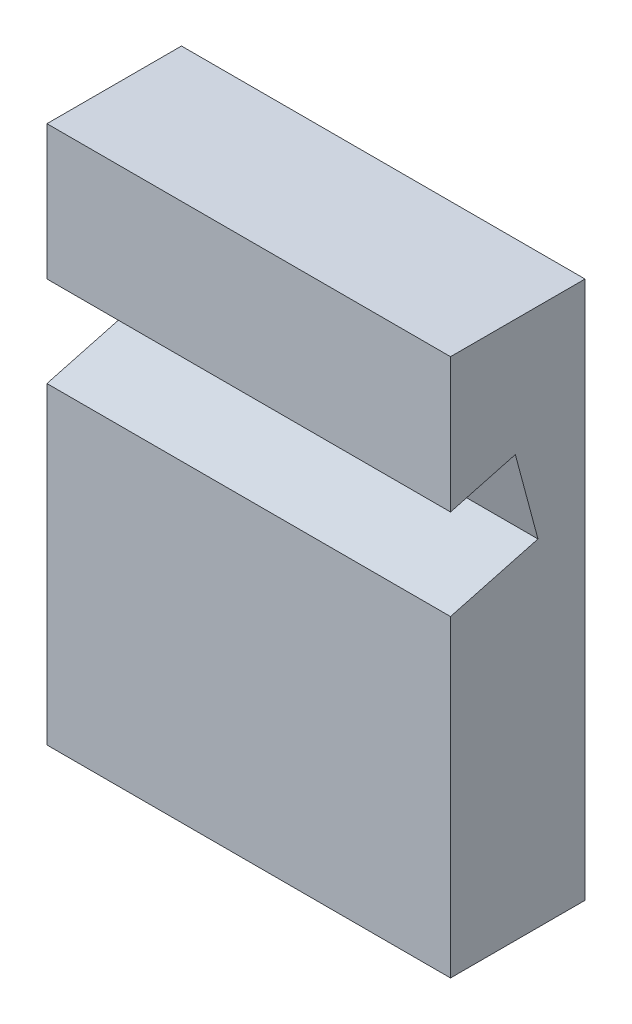
ISO-10303-21;
HEADER;
FILE_DESCRIPTION(('STEP AP214'),'2;1');
FILE_NAME('part.step','',(''),(''),'','','');
FILE_SCHEMA(('AUTOMOTIVE_DESIGN { 1 0 10303 214 1 1 1 1 }'));
ENDSEC;
DATA;
#1=APPLICATION_CONTEXT('core data for automotive mechanical design processes');
#2=APPLICATION_PROTOCOL_DEFINITION('international standard','automotive_design',2000,#1);
#3=PRODUCT_CONTEXT('',#1,'mechanical');
#4=PRODUCT('Part','Part','',(#3));
#5=PRODUCT_RELATED_PRODUCT_CATEGORY('part','',(#4));
#6=PRODUCT_DEFINITION_FORMATION('','',#4);
#7=PRODUCT_DEFINITION_CONTEXT('part definition',#1,'design');
#8=PRODUCT_DEFINITION('design','',#6,#7);
#9=PRODUCT_DEFINITION_SHAPE('','',#8);
#10=(LENGTH_UNIT() NAMED_UNIT(*) SI_UNIT(.MILLI.,.METRE.));
#11=(NAMED_UNIT(*) PLANE_ANGLE_UNIT() SI_UNIT($,.RADIAN.));
#12=(NAMED_UNIT(*) SI_UNIT($,.STERADIAN.) SOLID_ANGLE_UNIT());
#13=UNCERTAINTY_MEASURE_WITH_UNIT(LENGTH_MEASURE(1.E-05),#10,'distance_accuracy_value','');
#14=(GEOMETRIC_REPRESENTATION_CONTEXT(3) GLOBAL_UNCERTAINTY_ASSIGNED_CONTEXT((#13)) GLOBAL_UNIT_ASSIGNED_CONTEXT((#10,
#11,#12)) REPRESENTATION_CONTEXT('',''));
#15=CARTESIAN_POINT('',(0.,0.,0.));
#16=DIRECTION('',(0.,0.,1.));
#17=DIRECTION('',(1.,0.,0.));
#18=AXIS2_PLACEMENT_3D('',#15,#16,#17);
#19=CARTESIAN_POINT('',(60.,0.,20.));
#20=DIRECTION('',(0.,1.,0.));
#21=DIRECTION('',(0.,0.,1.));
#22=AXIS2_PLACEMENT_3D('',#19,#20,#21);
#23=PLANE('',#22);
#24=DIRECTION('',(0.,0.,-1.));
#25=VECTOR('',#24,1.);
#26=CARTESIAN_POINT('',(0.,0.,20.));
#27=LINE('',#26,#25);
#28=CARTESIAN_POINT('',(0.,0.,20.));
#29=VERTEX_POINT('',#28);
#30=CARTESIAN_POINT('',(0.,0.,0.));
#31=VERTEX_POINT('',#30);
#32=EDGE_CURVE('E139',#29,#31,#27,.T.);
#33=ORIENTED_EDGE('',*,*,#32,.T.);
#34=DIRECTION('',(-1.,0.,0.));
#35=VECTOR('',#34,1.);
#36=CARTESIAN_POINT('',(60.,0.,0.));
#37=LINE('',#36,#35);
#38=CARTESIAN_POINT('',(60.,0.,0.));
#39=VERTEX_POINT('',#38);
#40=EDGE_CURVE('E11',#39,#31,#37,.T.);
#41=ORIENTED_EDGE('',*,*,#40,.F.);
#42=DIRECTION('',(0.,0.,-1.));
#43=VECTOR('',#42,1.);
#44=CARTESIAN_POINT('',(60.,0.,20.));
#45=LINE('',#44,#43);
#46=CARTESIAN_POINT('',(60.,0.,20.));
#47=VERTEX_POINT('',#46);
#48=EDGE_CURVE('E153',#47,#39,#45,.T.);
#49=ORIENTED_EDGE('',*,*,#48,.F.);
#50=DIRECTION('',(-1.,0.,0.));
#51=VECTOR('',#50,1.);
#52=CARTESIAN_POINT('',(60.,0.,20.));
#53=LINE('',#52,#51);
#54=EDGE_CURVE('E135',#47,#29,#53,.T.);
#55=ORIENTED_EDGE('',*,*,#54,.T.);
#56=EDGE_LOOP('',(#33,#41,#49,#55));
#57=FACE_BOUND('',#56,.T.);
#58=ADVANCED_FACE('F43',(#57),#23,.F.);
#59=CARTESIAN_POINT('',(60.,0.,0.));
#60=DIRECTION('',(0.,0.,1.));
#61=DIRECTION('',(1.,0.,0.));
#62=AXIS2_PLACEMENT_3D('',#59,#60,#61);
#63=PLANE('',#62);
#64=DIRECTION('',(0.,1.,0.));
#65=VECTOR('',#64,1.);
#66=CARTESIAN_POINT('',(0.,0.,0.));
#67=LINE('',#66,#65);
#68=CARTESIAN_POINT('',(0.,80.,0.));
#69=VERTEX_POINT('',#68);
#70=EDGE_CURVE('E142',#31,#69,#67,.T.);
#71=ORIENTED_EDGE('',*,*,#70,.T.);
#72=DIRECTION('',(-1.,0.,0.));
#73=VECTOR('',#72,1.);
#74=CARTESIAN_POINT('',(60.,80.,0.));
#75=LINE('',#74,#73);
#76=CARTESIAN_POINT('',(60.,80.,0.));
#77=VERTEX_POINT('',#76);
#78=EDGE_CURVE('E51',#77,#69,#75,.T.);
#79=ORIENTED_EDGE('',*,*,#78,.F.);
#80=DIRECTION('',(0.,1.,0.));
#81=VECTOR('',#80,1.);
#82=CARTESIAN_POINT('',(60.,0.,0.));
#83=LINE('',#82,#81);
#84=EDGE_CURVE('E102',#39,#77,#83,.T.);
#85=ORIENTED_EDGE('',*,*,#84,.F.);
#86=ORIENTED_EDGE('',*,*,#40,.T.);
#87=EDGE_LOOP('',(#71,#79,#85,#86));
#88=FACE_BOUND('',#87,.T.);
#89=ADVANCED_FACE('F188',(#88),#63,.F.);
#90=CARTESIAN_POINT('',(60.,80.,0.));
#91=DIRECTION('',(0.,-1.,0.));
#92=DIRECTION('',(0.,0.,-1.));
#93=AXIS2_PLACEMENT_3D('',#90,#91,#92);
#94=PLANE('',#93);
#95=DIRECTION('',(0.,0.,1.));
#96=VECTOR('',#95,1.);
#97=CARTESIAN_POINT('',(0.,80.,0.));
#98=LINE('',#97,#96);
#99=CARTESIAN_POINT('',(0.,80.,20.));
#100=VERTEX_POINT('',#99);
#101=EDGE_CURVE('E144',#69,#100,#98,.T.);
#102=ORIENTED_EDGE('',*,*,#101,.T.);
#103=DIRECTION('',(-1.,0.,0.));
#104=VECTOR('',#103,1.);
#105=CARTESIAN_POINT('',(60.,80.,20.));
#106=LINE('',#105,#104);
#107=CARTESIAN_POINT('',(60.,80.,20.));
#108=VERTEX_POINT('',#107);
#109=EDGE_CURVE('E160',#108,#100,#106,.T.);
#110=ORIENTED_EDGE('',*,*,#109,.F.);
#111=DIRECTION('',(0.,0.,1.));
#112=VECTOR('',#111,1.);
#113=CARTESIAN_POINT('',(60.,80.,0.));
#114=LINE('',#113,#112);
#115=EDGE_CURVE('E168',#77,#108,#114,.T.);
#116=ORIENTED_EDGE('',*,*,#115,.F.);
#117=ORIENTED_EDGE('',*,*,#78,.T.);
#118=EDGE_LOOP('',(#102,#110,#116,#117));
#119=FACE_BOUND('',#118,.T.);
#120=ADVANCED_FACE('F166',(#119),#94,.F.);
#121=CARTESIAN_POINT('',(60.,80.,20.));
#122=DIRECTION('',(0.,0.,-1.));
#123=DIRECTION('',(0.,1.,0.));
#124=AXIS2_PLACEMENT_3D('',#121,#122,#123);
#125=PLANE('',#124);
#126=DIRECTION('',(0.,-1.,0.));
#127=VECTOR('',#126,1.);
#128=CARTESIAN_POINT('',(0.,80.,20.));
#129=LINE('',#128,#127);
#130=CARTESIAN_POINT('',(0.,60.,20.));
#131=VERTEX_POINT('',#130);
#132=EDGE_CURVE('E146',#100,#131,#129,.T.);
#133=ORIENTED_EDGE('',*,*,#132,.T.);
#134=DIRECTION('',(-1.,0.,0.));
#135=VECTOR('',#134,1.);
#136=CARTESIAN_POINT('',(60.,60.,20.));
#137=LINE('',#136,#135);
#138=CARTESIAN_POINT('',(60.,60.,20.));
#139=VERTEX_POINT('',#138);
#140=EDGE_CURVE('E157',#139,#131,#137,.T.);
#141=ORIENTED_EDGE('',*,*,#140,.F.);
#142=DIRECTION('',(0.,-1.,0.));
#143=VECTOR('',#142,1.);
#144=CARTESIAN_POINT('',(60.,80.,20.));
#145=LINE('',#144,#143);
#146=EDGE_CURVE('E180',#108,#139,#145,.T.);
#147=ORIENTED_EDGE('',*,*,#146,.F.);
#148=ORIENTED_EDGE('',*,*,#109,.T.);
#149=EDGE_LOOP('',(#133,#141,#147,#148));
#150=FACE_BOUND('',#149,.T.);
#151=ADVANCED_FACE('F176',(#150),#125,.F.);
#152=CARTESIAN_POINT('',(60.,60.,20.));
#153=DIRECTION('',(0.,0.96592582628907,0.258819045102515));
#154=DIRECTION('',(0.,-0.258819045102515,0.96592582628907));
#155=AXIS2_PLACEMENT_3D('',#152,#153,#154);
#156=PLANE('',#155);
#157=DIRECTION('',(0.,0.258819045102515,-0.96592582628907));
#158=VECTOR('',#157,1.);
#159=CARTESIAN_POINT('',(0.,60.,20.));
#160=LINE('',#159,#158);
#161=CARTESIAN_POINT('',(0.,62.5817848980314,10.3646475863327));
#162=VERTEX_POINT('',#161);
#163=EDGE_CURVE('E148',#131,#162,#160,.T.);
#164=ORIENTED_EDGE('',*,*,#163,.T.);
#165=DIRECTION('',(-1.,0.,0.));
#166=VECTOR('',#165,1.);
#167=CARTESIAN_POINT('',(60.,62.5817848980314,10.3646475863327));
#168=LINE('',#167,#166);
#169=CARTESIAN_POINT('',(60.,62.5817848980314,10.3646475863327));
#170=VERTEX_POINT('',#169);
#171=EDGE_CURVE('E130',#170,#162,#168,.T.);
#172=ORIENTED_EDGE('',*,*,#171,.F.);
#173=DIRECTION('',(0.,0.258819045102515,-0.96592582628907));
#174=VECTOR('',#173,1.);
#175=CARTESIAN_POINT('',(60.,60.,20.));
#176=LINE('',#175,#174);
#177=EDGE_CURVE('E121',#139,#170,#176,.T.);
#178=ORIENTED_EDGE('',*,*,#177,.F.);
#179=ORIENTED_EDGE('',*,*,#140,.T.);
#180=EDGE_LOOP('',(#164,#172,#178,#179));
#181=FACE_BOUND('',#180,.T.);
#182=ADVANCED_FACE('F179',(#181),#156,.F.);
#183=CARTESIAN_POINT('',(60.,62.5817848980314,10.3646475863327));
#184=DIRECTION('',(0.,0.258819045102515,-0.96592582628907));
#185=DIRECTION('',(0.,0.96592582628907,0.258819045102515));
#186=AXIS2_PLACEMENT_3D('',#183,#184,#185);
#187=PLANE('',#186);
#188=DIRECTION('',(0.,-0.96592582628907,-0.258819045102515));
#189=VECTOR('',#188,1.);
#190=CARTESIAN_POINT('',(0.,62.5817848980314,10.3646475863327));
#191=LINE('',#190,#189);
#192=CARTESIAN_POINT('',(0.,50.0247491562735,7.));
#193=VERTEX_POINT('',#192);
#194=EDGE_CURVE('E129',#162,#193,#191,.T.);
#195=ORIENTED_EDGE('',*,*,#194,.T.);
#196=DIRECTION('',(-1.,0.,0.));
#197=VECTOR('',#196,1.);
#198=CARTESIAN_POINT('',(60.,50.0247491562735,7.));
#199=LINE('',#198,#197);
#200=CARTESIAN_POINT('',(60.,50.0247491562735,7.));
#201=VERTEX_POINT('',#200);
#202=EDGE_CURVE('E126',#201,#193,#199,.T.);
#203=ORIENTED_EDGE('',*,*,#202,.F.);
#204=DIRECTION('',(0.,-0.96592582628907,-0.258819045102515));
#205=VECTOR('',#204,1.);
#206=CARTESIAN_POINT('',(60.,62.5817848980314,10.3646475863327));
#207=LINE('',#206,#205);
#208=EDGE_CURVE('E115',#170,#201,#207,.T.);
#209=ORIENTED_EDGE('',*,*,#208,.F.);
#210=ORIENTED_EDGE('',*,*,#171,.T.);
#211=EDGE_LOOP('',(#195,#203,#209,#210));
#212=FACE_BOUND('',#211,.T.);
#213=ADVANCED_FACE('F127',(#212),#187,.F.);
#214=CARTESIAN_POINT('',(60.,50.0247491562735,7.));
#215=DIRECTION('',(0.,-0.96592582628907,-0.258819045102515));
#216=DIRECTION('',(0.,0.258819045102515,-0.96592582628907));
#217=AXIS2_PLACEMENT_3D('',#214,#215,#216);
#218=PLANE('',#217);
#219=DIRECTION('',(0.,-0.258819045102515,0.96592582628907));
#220=VECTOR('',#219,1.);
#221=CARTESIAN_POINT('',(0.,50.0247491562735,7.));
#222=LINE('',#221,#220);
#223=CARTESIAN_POINT('',(0.,46.5414096546689,20.));
#224=VERTEX_POINT('',#223);
#225=EDGE_CURVE('E88',#193,#224,#222,.T.);
#226=ORIENTED_EDGE('',*,*,#225,.T.);
#227=DIRECTION('',(-1.,0.,0.));
#228=VECTOR('',#227,1.);
#229=CARTESIAN_POINT('',(60.,46.5414096546689,20.));
#230=LINE('',#229,#228);
#231=CARTESIAN_POINT('',(60.,46.5414096546689,20.));
#232=VERTEX_POINT('',#231);
#233=EDGE_CURVE('E131',#232,#224,#230,.T.);
#234=ORIENTED_EDGE('',*,*,#233,.F.);
#235=DIRECTION('',(0.,-0.258819045102515,0.96592582628907));
#236=VECTOR('',#235,1.);
#237=CARTESIAN_POINT('',(60.,50.0247491562735,7.));
#238=LINE('',#237,#236);
#239=EDGE_CURVE('E119',#201,#232,#238,.T.);
#240=ORIENTED_EDGE('',*,*,#239,.F.);
#241=ORIENTED_EDGE('',*,*,#202,.T.);
#242=EDGE_LOOP('',(#226,#234,#240,#241));
#243=FACE_BOUND('',#242,.T.);
#244=ADVANCED_FACE('F133',(#243),#218,.F.);
#245=CARTESIAN_POINT('',(60.,46.5414096546689,20.));
#246=DIRECTION('',(0.,0.,-1.));
#247=DIRECTION('',(0.,1.,0.));
#248=AXIS2_PLACEMENT_3D('',#245,#246,#247);
#249=PLANE('',#248);
#250=DIRECTION('',(0.,-1.,0.));
#251=VECTOR('',#250,1.);
#252=CARTESIAN_POINT('',(0.,46.5414096546689,20.));
#253=LINE('',#252,#251);
#254=EDGE_CURVE('E94',#224,#29,#253,.T.);
#255=ORIENTED_EDGE('',*,*,#254,.T.);
#256=ORIENTED_EDGE('',*,*,#54,.F.);
#257=DIRECTION('',(0.,-1.,0.));
#258=VECTOR('',#257,1.);
#259=CARTESIAN_POINT('',(60.,46.5414096546689,20.));
#260=LINE('',#259,#258);
#261=EDGE_CURVE('E59',#232,#47,#260,.T.);
#262=ORIENTED_EDGE('',*,*,#261,.F.);
#263=ORIENTED_EDGE('',*,*,#233,.T.);
#264=EDGE_LOOP('',(#255,#256,#262,#263));
#265=FACE_BOUND('',#264,.T.);
#266=ADVANCED_FACE('F204',(#265),#249,.F.);
#267=CARTESIAN_POINT('',(60.,0.,0.));
#268=DIRECTION('',(1.,0.,0.));
#269=DIRECTION('',(0.,0.,-1.));
#270=AXIS2_PLACEMENT_3D('',#267,#268,#269);
#271=PLANE('',#270);
#272=ORIENTED_EDGE('',*,*,#48,.T.);
#273=ORIENTED_EDGE('',*,*,#84,.T.);
#274=ORIENTED_EDGE('',*,*,#115,.T.);
#275=ORIENTED_EDGE('',*,*,#146,.T.);
#276=ORIENTED_EDGE('',*,*,#177,.T.);
#277=ORIENTED_EDGE('',*,*,#208,.T.);
#278=ORIENTED_EDGE('',*,*,#239,.T.);
#279=ORIENTED_EDGE('',*,*,#261,.T.);
#280=EDGE_LOOP('',(#272,#273,#274,#275,#276,#277,#278,#279));
#281=FACE_BOUND('',#280,.T.);
#282=ADVANCED_FACE('F117',(#281),#271,.T.);
#283=CARTESIAN_POINT('',(0.,0.,0.));
#284=DIRECTION('',(1.,0.,0.));
#285=DIRECTION('',(0.,0.,-1.));
#286=AXIS2_PLACEMENT_3D('',#283,#284,#285);
#287=PLANE('',#286);
#288=ORIENTED_EDGE('',*,*,#32,.F.);
#289=ORIENTED_EDGE('',*,*,#254,.F.);
#290=ORIENTED_EDGE('',*,*,#225,.F.);
#291=ORIENTED_EDGE('',*,*,#194,.F.);
#292=ORIENTED_EDGE('',*,*,#163,.F.);
#293=ORIENTED_EDGE('',*,*,#132,.F.);
#294=ORIENTED_EDGE('',*,*,#101,.F.);
#295=ORIENTED_EDGE('',*,*,#70,.F.);
#296=EDGE_LOOP('',(#288,#289,#290,#291,#292,#293,#294,#295));
#297=FACE_BOUND('',#296,.T.);
#298=ADVANCED_FACE('F172',(#297),#287,.F.);
#299=CLOSED_SHELL('',(#58,#89,#120,#151,#182,#213,#244,#266,#282,#298));
#300=MANIFOLD_SOLID_BREP('B2',#299);
#301=ADVANCED_BREP_SHAPE_REPRESENTATION('',(#18,#300),#14);
#302=SHAPE_DEFINITION_REPRESENTATION(#9,#301);
ENDSEC;
END-ISO-10303-21;
